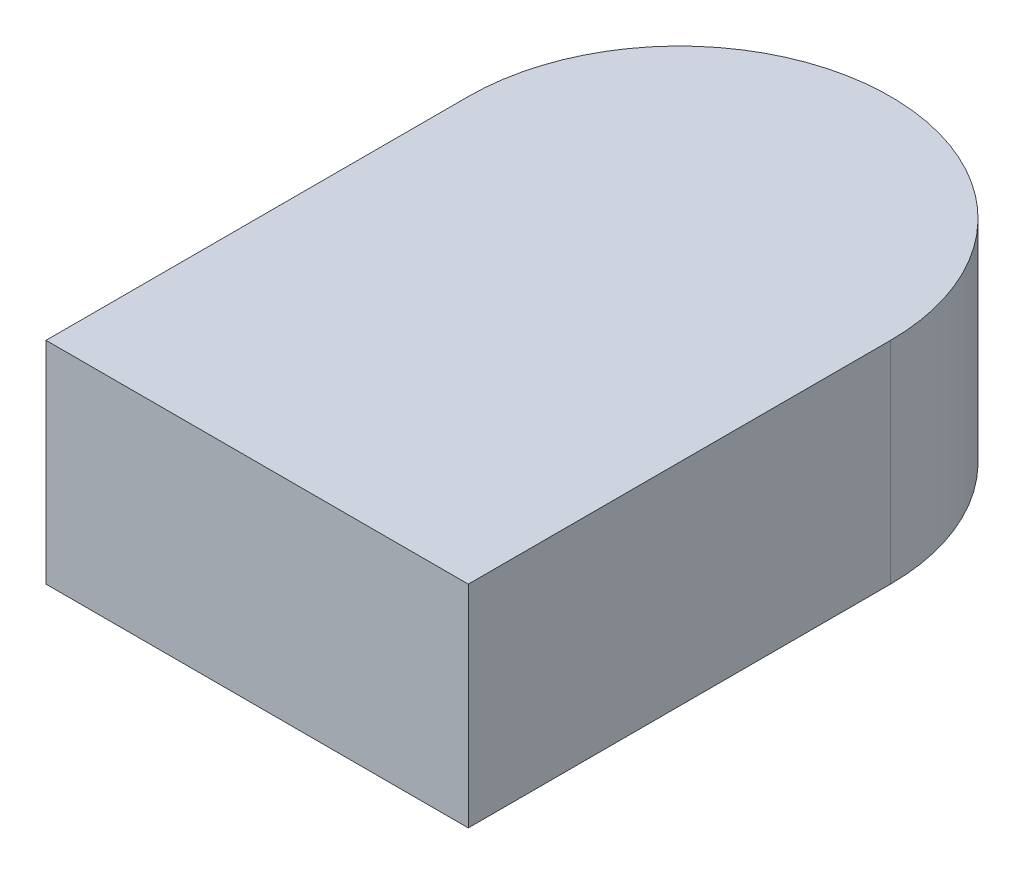
ISO-10303-21;
HEADER;
FILE_DESCRIPTION(('STEP AP214'),'2;1');
FILE_NAME('part.step','',(''),(''),'','','');
FILE_SCHEMA(('AUTOMOTIVE_DESIGN { 1 0 10303 214 1 1 1 1 }'));
ENDSEC;
DATA;
#1=APPLICATION_CONTEXT('core data for automotive mechanical design processes');
#2=APPLICATION_PROTOCOL_DEFINITION('international standard','automotive_design',2000,#1);
#3=PRODUCT_CONTEXT('',#1,'mechanical');
#4=PRODUCT('Part','Part','',(#3));
#5=PRODUCT_RELATED_PRODUCT_CATEGORY('part','',(#4));
#6=PRODUCT_DEFINITION_FORMATION('','',#4);
#7=PRODUCT_DEFINITION_CONTEXT('part definition',#1,'design');
#8=PRODUCT_DEFINITION('design','',#6,#7);
#9=PRODUCT_DEFINITION_SHAPE('','',#8);
#10=(LENGTH_UNIT() NAMED_UNIT(*) SI_UNIT(.MILLI.,.METRE.));
#11=(NAMED_UNIT(*) PLANE_ANGLE_UNIT() SI_UNIT($,.RADIAN.));
#12=(NAMED_UNIT(*) SI_UNIT($,.STERADIAN.) SOLID_ANGLE_UNIT());
#13=UNCERTAINTY_MEASURE_WITH_UNIT(LENGTH_MEASURE(1.E-05),#10,'distance_accuracy_value','');
#14=(GEOMETRIC_REPRESENTATION_CONTEXT(3) GLOBAL_UNCERTAINTY_ASSIGNED_CONTEXT((#13)) GLOBAL_UNIT_ASSIGNED_CONTEXT((#10,
#11,#12)) REPRESENTATION_CONTEXT('',''));
#15=CARTESIAN_POINT('',(0.,0.,0.));
#16=DIRECTION('',(0.,0.,1.));
#17=DIRECTION('',(1.,0.,0.));
#18=AXIS2_PLACEMENT_3D('',#15,#16,#17);
#19=CARTESIAN_POINT('',(0.,0.,0.));
#20=DIRECTION('',(0.,-1.,0.));
#21=DIRECTION('',(1.,0.,0.));
#22=AXIS2_PLACEMENT_3D('',#19,#20,#21);
#23=PLANE('',#22);
#24=CARTESIAN_POINT('',(0.4,0.,2.05));
#25=DIRECTION('',(0.,-1.,0.));
#26=DIRECTION('',(-1.,0.,0.));
#27=AXIS2_PLACEMENT_3D('',#24,#25,#26);
#28=CIRCLE('',#27,0.1);
#29=CARTESIAN_POINT('',(0.3,0.,2.05));
#30=VERTEX_POINT('',#29);
#31=CARTESIAN_POINT('',(0.5,0.,2.05));
#32=VERTEX_POINT('',#31);
#33=EDGE_CURVE('E11',#30,#32,#28,.T.);
#34=ORIENTED_EDGE('',*,*,#33,.T.);
#35=DIRECTION('',(0.,0.,1.));
#36=VECTOR('',#35,1.);
#37=CARTESIAN_POINT('',(0.5,0.,2.05));
#38=LINE('',#37,#36);
#39=CARTESIAN_POINT('',(0.5,0.,2.25));
#40=VERTEX_POINT('',#39);
#41=EDGE_CURVE('E25',#32,#40,#38,.T.);
#42=ORIENTED_EDGE('',*,*,#41,.T.);
#43=DIRECTION('',(-1.,0.,0.));
#44=VECTOR('',#43,1.);
#45=CARTESIAN_POINT('',(0.5,0.,2.25));
#46=LINE('',#45,#44);
#47=CARTESIAN_POINT('',(0.3,0.,2.25));
#48=VERTEX_POINT('',#47);
#49=EDGE_CURVE('E73',#40,#48,#46,.T.);
#50=ORIENTED_EDGE('',*,*,#49,.T.);
#51=DIRECTION('',(0.,0.,-1.));
#52=VECTOR('',#51,1.);
#53=CARTESIAN_POINT('',(0.3,0.,2.25));
#54=LINE('',#53,#52);
#55=EDGE_CURVE('E99',#48,#30,#54,.T.);
#56=ORIENTED_EDGE('',*,*,#55,.T.);
#57=EDGE_LOOP('',(#34,#42,#50,#56));
#58=FACE_BOUND('',#57,.T.);
#59=ADVANCED_FACE('F17',(#58),#23,.T.);
#60=CARTESIAN_POINT('',(0.3,0.,2.25));
#61=DIRECTION('',(1.,0.,0.));
#62=DIRECTION('',(0.,0.,-1.));
#63=AXIS2_PLACEMENT_3D('',#60,#61,#62);
#64=PLANE('',#63);
#65=DIRECTION('',(0.,1.,0.));
#66=VECTOR('',#65,1.);
#67=CARTESIAN_POINT('',(0.3,0.,2.25));
#68=LINE('',#67,#66);
#69=CARTESIAN_POINT('',(0.3,0.1,2.25));
#70=VERTEX_POINT('',#69);
#71=EDGE_CURVE('E95',#48,#70,#68,.T.);
#72=ORIENTED_EDGE('',*,*,#71,.T.);
#73=DIRECTION('',(0.,0.,-1.));
#74=VECTOR('',#73,1.);
#75=CARTESIAN_POINT('',(0.3,0.1,2.25));
#76=LINE('',#75,#74);
#77=CARTESIAN_POINT('',(0.3,0.1,2.05));
#78=VERTEX_POINT('',#77);
#79=EDGE_CURVE('E68',#70,#78,#76,.T.);
#80=ORIENTED_EDGE('',*,*,#79,.T.);
#81=DIRECTION('',(0.,1.,0.));
#82=VECTOR('',#81,1.);
#83=CARTESIAN_POINT('',(0.3,0.,2.05));
#84=LINE('',#83,#82);
#85=EDGE_CURVE('E87',#30,#78,#84,.T.);
#86=ORIENTED_EDGE('',*,*,#85,.F.);
#87=ORIENTED_EDGE('',*,*,#55,.F.);
#88=EDGE_LOOP('',(#72,#80,#86,#87));
#89=FACE_BOUND('',#88,.T.);
#90=ADVANCED_FACE('F113',(#89),#64,.F.);
#91=CARTESIAN_POINT('',(0.4,0.,2.05));
#92=DIRECTION('',(0.,-1.,0.));
#93=DIRECTION('',(0.,0.,1.));
#94=AXIS2_PLACEMENT_3D('',#91,#92,#93);
#95=CYLINDRICAL_SURFACE('',#94,0.1);
#96=ORIENTED_EDGE('',*,*,#85,.T.);
#97=CARTESIAN_POINT('',(0.4,0.1,2.05));
#98=DIRECTION('',(0.,-1.,0.));
#99=DIRECTION('',(-1.,0.,0.));
#100=AXIS2_PLACEMENT_3D('',#97,#98,#99);
#101=CIRCLE('',#100,0.1);
#102=CARTESIAN_POINT('',(0.5,0.1,2.05));
#103=VERTEX_POINT('',#102);
#104=EDGE_CURVE('E83',#78,#103,#101,.T.);
#105=ORIENTED_EDGE('',*,*,#104,.T.);
#106=DIRECTION('',(0.,1.,0.));
#107=VECTOR('',#106,1.);
#108=CARTESIAN_POINT('',(0.5,0.,2.05));
#109=LINE('',#108,#107);
#110=EDGE_CURVE('E60',#32,#103,#109,.T.);
#111=ORIENTED_EDGE('',*,*,#110,.F.);
#112=ORIENTED_EDGE('',*,*,#33,.F.);
#113=EDGE_LOOP('',(#96,#105,#111,#112));
#114=FACE_BOUND('',#113,.T.);
#115=ADVANCED_FACE('F115',(#114),#95,.T.);
#116=CARTESIAN_POINT('',(0.5,0.,2.05));
#117=DIRECTION('',(-1.,0.,0.));
#118=DIRECTION('',(0.,0.,1.));
#119=AXIS2_PLACEMENT_3D('',#116,#117,#118);
#120=PLANE('',#119);
#121=ORIENTED_EDGE('',*,*,#110,.T.);
#122=DIRECTION('',(0.,0.,1.));
#123=VECTOR('',#122,1.);
#124=CARTESIAN_POINT('',(0.5,0.1,2.05));
#125=LINE('',#124,#123);
#126=CARTESIAN_POINT('',(0.5,0.1,2.25));
#127=VERTEX_POINT('',#126);
#128=EDGE_CURVE('E53',#103,#127,#125,.T.);
#129=ORIENTED_EDGE('',*,*,#128,.T.);
#130=DIRECTION('',(0.,1.,0.));
#131=VECTOR('',#130,1.);
#132=CARTESIAN_POINT('',(0.5,0.,2.25));
#133=LINE('',#132,#131);
#134=EDGE_CURVE('E57',#40,#127,#133,.T.);
#135=ORIENTED_EDGE('',*,*,#134,.F.);
#136=ORIENTED_EDGE('',*,*,#41,.F.);
#137=EDGE_LOOP('',(#121,#129,#135,#136));
#138=FACE_BOUND('',#137,.T.);
#139=ADVANCED_FACE('F55',(#138),#120,.F.);
#140=CARTESIAN_POINT('',(0.5,0.,2.25));
#141=DIRECTION('',(0.,0.,-1.));
#142=DIRECTION('',(-1.,0.,0.));
#143=AXIS2_PLACEMENT_3D('',#140,#141,#142);
#144=PLANE('',#143);
#145=ORIENTED_EDGE('',*,*,#134,.T.);
#146=DIRECTION('',(-1.,0.,0.));
#147=VECTOR('',#146,1.);
#148=CARTESIAN_POINT('',(0.5,0.1,2.25));
#149=LINE('',#148,#147);
#150=EDGE_CURVE('E66',#127,#70,#149,.T.);
#151=ORIENTED_EDGE('',*,*,#150,.T.);
#152=ORIENTED_EDGE('',*,*,#71,.F.);
#153=ORIENTED_EDGE('',*,*,#49,.F.);
#154=EDGE_LOOP('',(#145,#151,#152,#153));
#155=FACE_BOUND('',#154,.T.);
#156=ADVANCED_FACE('F72',(#155),#144,.F.);
#157=CARTESIAN_POINT('',(0.,0.1,0.));
#158=DIRECTION('',(0.,-1.,0.));
#159=DIRECTION('',(1.,0.,0.));
#160=AXIS2_PLACEMENT_3D('',#157,#158,#159);
#161=PLANE('',#160);
#162=ORIENTED_EDGE('',*,*,#150,.F.);
#163=ORIENTED_EDGE('',*,*,#128,.F.);
#164=ORIENTED_EDGE('',*,*,#104,.F.);
#165=ORIENTED_EDGE('',*,*,#79,.F.);
#166=EDGE_LOOP('',(#162,#163,#164,#165));
#167=FACE_BOUND('',#166,.T.);
#168=ADVANCED_FACE('F67',(#167),#161,.F.);
#169=CLOSED_SHELL('',(#59,#90,#115,#139,#156,#168));
#170=MANIFOLD_SOLID_BREP('B1',#169);
#171=ADVANCED_BREP_SHAPE_REPRESENTATION('',(#18,#170),#14);
#172=SHAPE_DEFINITION_REPRESENTATION(#9,#171);
ENDSEC;
END-ISO-10303-21;
